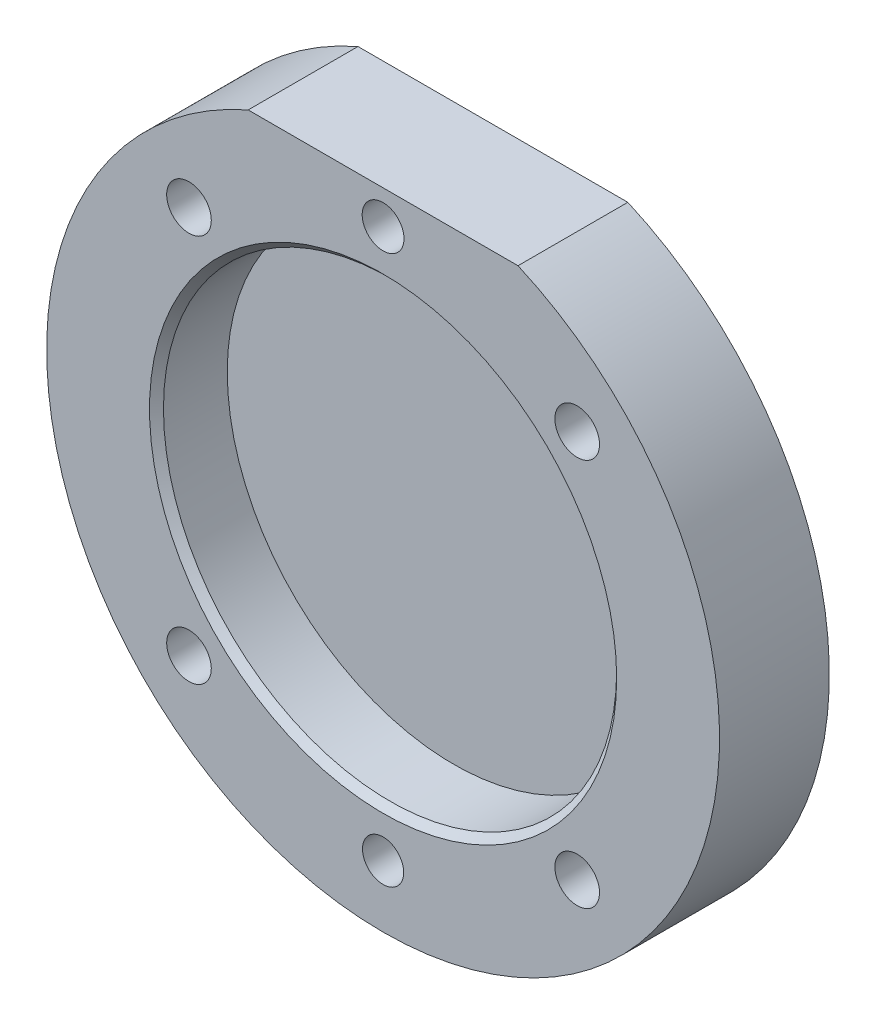
ISO-10303-21;
HEADER;
FILE_DESCRIPTION(('STEP AP214'),'2;1');
FILE_NAME('part.step','',(''),(''),'','','');
FILE_SCHEMA(('AUTOMOTIVE_DESIGN { 1 0 10303 214 1 1 1 1 }'));
ENDSEC;
DATA;
#1=APPLICATION_CONTEXT('core data for automotive mechanical design processes');
#2=APPLICATION_PROTOCOL_DEFINITION('international standard','automotive_design',2000,#1);
#3=PRODUCT_CONTEXT('',#1,'mechanical');
#4=PRODUCT('Part','Part','',(#3));
#5=PRODUCT_RELATED_PRODUCT_CATEGORY('part','',(#4));
#6=PRODUCT_DEFINITION_FORMATION('','',#4);
#7=PRODUCT_DEFINITION_CONTEXT('part definition',#1,'design');
#8=PRODUCT_DEFINITION('design','',#6,#7);
#9=PRODUCT_DEFINITION_SHAPE('','',#8);
#10=(LENGTH_UNIT() NAMED_UNIT(*) SI_UNIT(.MILLI.,.METRE.));
#11=(NAMED_UNIT(*) PLANE_ANGLE_UNIT() SI_UNIT($,.RADIAN.));
#12=(NAMED_UNIT(*) SI_UNIT($,.STERADIAN.) SOLID_ANGLE_UNIT());
#13=UNCERTAINTY_MEASURE_WITH_UNIT(LENGTH_MEASURE(1.E-05),#10,'distance_accuracy_value','');
#14=(GEOMETRIC_REPRESENTATION_CONTEXT(3) GLOBAL_UNCERTAINTY_ASSIGNED_CONTEXT((#13)) GLOBAL_UNIT_ASSIGNED_CONTEXT((#10,
#11,#12)) REPRESENTATION_CONTEXT('',''));
#15=CARTESIAN_POINT('',(0.,0.,0.));
#16=DIRECTION('',(0.,0.,1.));
#17=DIRECTION('',(1.,0.,0.));
#18=AXIS2_PLACEMENT_3D('',#15,#16,#17);
#19=CARTESIAN_POINT('',(0.,0.,8.001));
#20=DIRECTION('',(0.,0.,-1.));
#21=DIRECTION('',(-1.,0.,0.));
#22=AXIS2_PLACEMENT_3D('',#19,#20,#21);
#23=CYLINDRICAL_SURFACE('',#22,24.511);
#24=CARTESIAN_POINT('',(0.,0.,0.));
#25=DIRECTION('',(0.,0.,1.));
#26=DIRECTION('',(1.,0.,0.));
#27=AXIS2_PLACEMENT_3D('',#24,#25,#26);
#28=CIRCLE('',#27,24.511);
#29=CARTESIAN_POINT('',(-9.82979999999999,22.4536,0.));
#30=VERTEX_POINT('',#29);
#31=CARTESIAN_POINT('',(9.82979999999999,22.4536,0.));
#32=VERTEX_POINT('',#31);
#33=EDGE_CURVE('E68',#30,#32,#28,.T.);
#34=ORIENTED_EDGE('',*,*,#33,.T.);
#35=DIRECTION('',(0.,0.,-1.));
#36=VECTOR('',#35,1.);
#37=CARTESIAN_POINT('',(9.82979999999999,22.4536,8.001));
#38=LINE('',#37,#36);
#39=CARTESIAN_POINT('',(9.82979999999999,22.4536,8.001));
#40=VERTEX_POINT('',#39);
#41=EDGE_CURVE('E65',#40,#32,#38,.T.);
#42=ORIENTED_EDGE('',*,*,#41,.F.);
#43=CARTESIAN_POINT('',(0.,0.,8.001));
#44=DIRECTION('',(0.,0.,1.));
#45=DIRECTION('',(1.,0.,0.));
#46=AXIS2_PLACEMENT_3D('',#43,#44,#45);
#47=CIRCLE('',#46,24.511);
#48=CARTESIAN_POINT('',(-9.82979999999999,22.4536,8.001));
#49=VERTEX_POINT('',#48);
#50=EDGE_CURVE('E67',#49,#40,#47,.T.);
#51=ORIENTED_EDGE('',*,*,#50,.F.);
#52=DIRECTION('',(0.,0.,-1.));
#53=VECTOR('',#52,1.);
#54=CARTESIAN_POINT('',(-9.82979999999999,22.4536,8.001));
#55=LINE('',#54,#53);
#56=EDGE_CURVE('E62',#49,#30,#55,.T.);
#57=ORIENTED_EDGE('',*,*,#56,.T.);
#58=EDGE_LOOP('',(#34,#42,#51,#57));
#59=FACE_BOUND('',#58,.T.);
#60=ADVANCED_FACE('F33',(#59),#23,.T.);
#61=CARTESIAN_POINT('',(-9.82979999999999,22.4536,8.001));
#62=DIRECTION('',(0.,-1.,0.));
#63=DIRECTION('',(0.,0.,-1.));
#64=AXIS2_PLACEMENT_3D('',#61,#62,#63);
#65=PLANE('',#64);
#66=DIRECTION('',(-1.,0.,0.));
#67=VECTOR('',#66,1.);
#68=CARTESIAN_POINT('',(-9.82979999999999,22.4536,0.));
#69=LINE('',#68,#67);
#70=EDGE_CURVE('E57',#32,#30,#69,.T.);
#71=ORIENTED_EDGE('',*,*,#70,.T.);
#72=ORIENTED_EDGE('',*,*,#56,.F.);
#73=DIRECTION('',(-1.,0.,0.));
#74=VECTOR('',#73,1.);
#75=CARTESIAN_POINT('',(-9.82979999999999,22.4536,8.001));
#76=LINE('',#75,#74);
#77=EDGE_CURVE('E49',#40,#49,#76,.T.);
#78=ORIENTED_EDGE('',*,*,#77,.F.);
#79=ORIENTED_EDGE('',*,*,#41,.T.);
#80=EDGE_LOOP('',(#71,#72,#78,#79));
#81=FACE_BOUND('',#80,.T.);
#82=ADVANCED_FACE('F61',(#81),#65,.F.);
#83=CARTESIAN_POINT('',(0.,0.,8.001));
#84=DIRECTION('',(0.,0.,1.));
#85=DIRECTION('',(1.,0.,0.));
#86=AXIS2_PLACEMENT_3D('',#83,#84,#85);
#87=PLANE('',#86);
#88=CARTESIAN_POINT('',(0.,0.,8.001));
#89=DIRECTION('',(0.,0.,1.));
#90=DIRECTION('',(1.,0.,0.));
#91=AXIS2_PLACEMENT_3D('',#88,#89,#90);
#92=CIRCLE('',#91,17.018);
#93=CARTESIAN_POINT('',(17.018,0.,8.001));
#94=VERTEX_POINT('',#93);
#95=EDGE_CURVE('E11',#94,#94,#92,.F.);
#96=ORIENTED_EDGE('',*,*,#95,.T.);
#97=EDGE_LOOP('',(#96));
#98=FACE_BOUND('',#97,.T.);
#99=CARTESIAN_POINT('',(0.,-20.0025,8.001));
#100=DIRECTION('',(0.,0.,1.));
#101=DIRECTION('',(1.,0.,0.));
#102=AXIS2_PLACEMENT_3D('',#99,#100,#101);
#103=CIRCLE('',#102,1.49987000000001);
#104=CARTESIAN_POINT('',(1.49987000000002,-20.0025,8.001));
#105=VERTEX_POINT('',#104);
#106=EDGE_CURVE('E214',#105,#105,#103,.T.);
#107=ORIENTED_EDGE('',*,*,#106,.F.);
#108=EDGE_LOOP('',(#107));
#109=FACE_BOUND('',#108,.T.);
#110=CARTESIAN_POINT('',(-14.1421073394598,-14.1421073394596,8.00100000000004));
#111=DIRECTION('',(0.,0.,1.));
#112=DIRECTION('',(0.,-1.,0.));
#113=AXIS2_PLACEMENT_3D('',#110,#111,#112);
#114=CIRCLE('',#113,1.62560000000001);
#115=CARTESIAN_POINT('',(-14.1421073394598,-15.7677073394596,8.00100000000004));
#116=VERTEX_POINT('',#115);
#117=EDGE_CURVE('E216',#116,#116,#114,.T.);
#118=ORIENTED_EDGE('',*,*,#117,.F.);
#119=EDGE_LOOP('',(#118));
#120=FACE_BOUND('',#119,.T.);
#121=CARTESIAN_POINT('',(14.1421073394596,-14.1421073394598,8.00100000000003));
#122=DIRECTION('',(0.,0.,1.));
#123=DIRECTION('',(0.,-1.,0.));
#124=AXIS2_PLACEMENT_3D('',#121,#122,#123);
#125=CIRCLE('',#124,1.62560000000001);
#126=CARTESIAN_POINT('',(14.1421073394596,-15.7677073394598,8.00100000000004));
#127=VERTEX_POINT('',#126);
#128=EDGE_CURVE('E227',#127,#127,#125,.T.);
#129=ORIENTED_EDGE('',*,*,#128,.F.);
#130=EDGE_LOOP('',(#129));
#131=FACE_BOUND('',#130,.T.);
#132=CARTESIAN_POINT('',(14.1421073394597,14.1421073394597,8.00099999999999));
#133=DIRECTION('',(0.,0.,1.));
#134=DIRECTION('',(0.,-1.,0.));
#135=AXIS2_PLACEMENT_3D('',#132,#133,#134);
#136=CIRCLE('',#135,1.62560000000001);
#137=CARTESIAN_POINT('',(14.1421073394597,12.5165073394597,8.00099999999999));
#138=VERTEX_POINT('',#137);
#139=EDGE_CURVE('E233',#138,#138,#136,.T.);
#140=ORIENTED_EDGE('',*,*,#139,.F.);
#141=EDGE_LOOP('',(#140));
#142=FACE_BOUND('',#141,.T.);
#143=CARTESIAN_POINT('',(-14.1421073394597,14.1421073394597,8.001));
#144=DIRECTION('',(0.,0.,1.));
#145=DIRECTION('',(1.,0.,0.));
#146=AXIS2_PLACEMENT_3D('',#143,#144,#145);
#147=CIRCLE('',#146,1.62560000000001);
#148=CARTESIAN_POINT('',(-12.5165073394597,14.1421073394597,8.001));
#149=VERTEX_POINT('',#148);
#150=EDGE_CURVE('E239',#149,#149,#147,.T.);
#151=ORIENTED_EDGE('',*,*,#150,.F.);
#152=EDGE_LOOP('',(#151));
#153=FACE_BOUND('',#152,.T.);
#154=CARTESIAN_POINT('',(0.,19.99996,8.001));
#155=DIRECTION('',(0.,0.,1.));
#156=DIRECTION('',(1.,0.,0.));
#157=AXIS2_PLACEMENT_3D('',#154,#155,#156);
#158=CIRCLE('',#157,1.52400000000001);
#159=CARTESIAN_POINT('',(1.52400000000001,19.99996,8.001));
#160=VERTEX_POINT('',#159);
#161=EDGE_CURVE('E76',#160,#160,#158,.T.);
#162=ORIENTED_EDGE('',*,*,#161,.F.);
#163=EDGE_LOOP('',(#162));
#164=FACE_BOUND('',#163,.T.);
#165=ORIENTED_EDGE('',*,*,#50,.T.);
#166=ORIENTED_EDGE('',*,*,#77,.T.);
#167=EDGE_LOOP('',(#165,#166));
#168=FACE_BOUND('',#167,.T.);
#169=ADVANCED_FACE('F100',(#98,#109,#120,#131,#142,#153,#164,#168),#87,.T.);
#170=CARTESIAN_POINT('',(0.,0.,0.));
#171=DIRECTION('',(0.,0.,1.));
#172=DIRECTION('',(1.,0.,0.));
#173=AXIS2_PLACEMENT_3D('',#170,#171,#172);
#174=PLANE('',#173);
#175=CARTESIAN_POINT('',(0.,-20.0025,0.));
#176=DIRECTION('',(0.,0.,1.));
#177=DIRECTION('',(1.,0.,0.));
#178=AXIS2_PLACEMENT_3D('',#175,#176,#177);
#179=CIRCLE('',#178,1.49987000000001);
#180=CARTESIAN_POINT('',(1.49987000000001,-20.0025,0.));
#181=VERTEX_POINT('',#180);
#182=EDGE_CURVE('E211',#181,#181,#179,.T.);
#183=ORIENTED_EDGE('',*,*,#182,.T.);
#184=EDGE_LOOP('',(#183));
#185=FACE_BOUND('',#184,.T.);
#186=CARTESIAN_POINT('',(-14.1421073394598,-14.1421073394596,0.));
#187=DIRECTION('',(0.,0.,1.));
#188=DIRECTION('',(0.,-1.,0.));
#189=AXIS2_PLACEMENT_3D('',#186,#187,#188);
#190=CIRCLE('',#189,1.62560000000001);
#191=CARTESIAN_POINT('',(-14.1421073394598,-15.7677073394596,0.));
#192=VERTEX_POINT('',#191);
#193=EDGE_CURVE('E219',#192,#192,#190,.T.);
#194=ORIENTED_EDGE('',*,*,#193,.T.);
#195=EDGE_LOOP('',(#194));
#196=FACE_BOUND('',#195,.T.);
#197=CARTESIAN_POINT('',(14.1421073394596,-14.1421073394598,0.));
#198=DIRECTION('',(0.,0.,1.));
#199=DIRECTION('',(0.,-1.,0.));
#200=AXIS2_PLACEMENT_3D('',#197,#198,#199);
#201=CIRCLE('',#200,1.62560000000001);
#202=CARTESIAN_POINT('',(14.1421073394596,-15.7677073394598,0.));
#203=VERTEX_POINT('',#202);
#204=EDGE_CURVE('E230',#203,#203,#201,.T.);
#205=ORIENTED_EDGE('',*,*,#204,.T.);
#206=EDGE_LOOP('',(#205));
#207=FACE_BOUND('',#206,.T.);
#208=CARTESIAN_POINT('',(14.1421073394597,14.1421073394597,0.));
#209=DIRECTION('',(0.,0.,1.));
#210=DIRECTION('',(0.,-1.,0.));
#211=AXIS2_PLACEMENT_3D('',#208,#209,#210);
#212=CIRCLE('',#211,1.62560000000001);
#213=CARTESIAN_POINT('',(14.1421073394597,12.5165073394597,0.));
#214=VERTEX_POINT('',#213);
#215=EDGE_CURVE('E236',#214,#214,#212,.T.);
#216=ORIENTED_EDGE('',*,*,#215,.T.);
#217=EDGE_LOOP('',(#216));
#218=FACE_BOUND('',#217,.T.);
#219=CARTESIAN_POINT('',(-14.1421073394597,14.1421073394597,0.));
#220=DIRECTION('',(0.,0.,1.));
#221=DIRECTION('',(1.,0.,0.));
#222=AXIS2_PLACEMENT_3D('',#219,#220,#221);
#223=CIRCLE('',#222,1.62560000000001);
#224=CARTESIAN_POINT('',(-12.5165073394597,14.1421073394597,0.));
#225=VERTEX_POINT('',#224);
#226=EDGE_CURVE('E242',#225,#225,#223,.T.);
#227=ORIENTED_EDGE('',*,*,#226,.T.);
#228=EDGE_LOOP('',(#227));
#229=FACE_BOUND('',#228,.T.);
#230=CARTESIAN_POINT('',(0.,19.99996,0.));
#231=DIRECTION('',(0.,0.,1.));
#232=DIRECTION('',(1.,0.,0.));
#233=AXIS2_PLACEMENT_3D('',#230,#231,#232);
#234=CIRCLE('',#233,1.52400000000001);
#235=CARTESIAN_POINT('',(1.52400000000001,19.99996,0.));
#236=VERTEX_POINT('',#235);
#237=EDGE_CURVE('E73',#236,#236,#234,.T.);
#238=ORIENTED_EDGE('',*,*,#237,.T.);
#239=EDGE_LOOP('',(#238));
#240=FACE_BOUND('',#239,.T.);
#241=ORIENTED_EDGE('',*,*,#33,.F.);
#242=ORIENTED_EDGE('',*,*,#70,.F.);
#243=EDGE_LOOP('',(#241,#242));
#244=FACE_BOUND('',#243,.T.);
#245=ADVANCED_FACE('F72',(#185,#196,#207,#218,#229,#240,#244),#174,.F.);
#246=CARTESIAN_POINT('',(0.,19.99996,8.001));
#247=DIRECTION('',(0.,0.,1.));
#248=DIRECTION('',(1.,0.,0.));
#249=AXIS2_PLACEMENT_3D('',#246,#247,#248);
#250=CYLINDRICAL_SURFACE('',#249,1.52400000000001);
#251=ORIENTED_EDGE('',*,*,#237,.F.);
#252=EDGE_LOOP('',(#251));
#253=FACE_BOUND('',#252,.T.);
#254=ORIENTED_EDGE('',*,*,#161,.T.);
#255=EDGE_LOOP('',(#254));
#256=FACE_BOUND('',#255,.T.);
#257=ADVANCED_FACE('F105',(#253,#256),#250,.F.);
#258=CARTESIAN_POINT('',(-14.1421073394597,14.1421073394597,8.001));
#259=DIRECTION('',(0.,0.,1.));
#260=DIRECTION('',(1.,0.,0.));
#261=AXIS2_PLACEMENT_3D('',#258,#259,#260);
#262=CYLINDRICAL_SURFACE('',#261,1.62560000000001);
#263=ORIENTED_EDGE('',*,*,#226,.F.);
#264=EDGE_LOOP('',(#263));
#265=FACE_BOUND('',#264,.T.);
#266=ORIENTED_EDGE('',*,*,#150,.T.);
#267=EDGE_LOOP('',(#266));
#268=FACE_BOUND('',#267,.T.);
#269=ADVANCED_FACE('F112',(#265,#268),#262,.F.);
#270=CARTESIAN_POINT('',(14.1421073394597,14.1421073394597,8.00099999999999));
#271=DIRECTION('',(0.,0.,1.));
#272=DIRECTION('',(0.,-1.,0.));
#273=AXIS2_PLACEMENT_3D('',#270,#271,#272);
#274=CYLINDRICAL_SURFACE('',#273,1.62560000000001);
#275=ORIENTED_EDGE('',*,*,#215,.F.);
#276=EDGE_LOOP('',(#275));
#277=FACE_BOUND('',#276,.T.);
#278=ORIENTED_EDGE('',*,*,#139,.T.);
#279=EDGE_LOOP('',(#278));
#280=FACE_BOUND('',#279,.T.);
#281=ADVANCED_FACE('F116',(#277,#280),#274,.F.);
#282=CARTESIAN_POINT('',(14.1421073394596,-14.1421073394598,8.00100000000003));
#283=DIRECTION('',(0.,0.,1.));
#284=DIRECTION('',(0.,-1.,0.));
#285=AXIS2_PLACEMENT_3D('',#282,#283,#284);
#286=CYLINDRICAL_SURFACE('',#285,1.62560000000001);
#287=ORIENTED_EDGE('',*,*,#204,.F.);
#288=EDGE_LOOP('',(#287));
#289=FACE_BOUND('',#288,.T.);
#290=ORIENTED_EDGE('',*,*,#128,.T.);
#291=EDGE_LOOP('',(#290));
#292=FACE_BOUND('',#291,.T.);
#293=ADVANCED_FACE('F120',(#289,#292),#286,.F.);
#294=CARTESIAN_POINT('',(-14.1421073394598,-14.1421073394596,8.00100000000004));
#295=DIRECTION('',(0.,0.,1.));
#296=DIRECTION('',(0.,-1.,0.));
#297=AXIS2_PLACEMENT_3D('',#294,#295,#296);
#298=CYLINDRICAL_SURFACE('',#297,1.62560000000001);
#299=ORIENTED_EDGE('',*,*,#193,.F.);
#300=EDGE_LOOP('',(#299));
#301=FACE_BOUND('',#300,.T.);
#302=ORIENTED_EDGE('',*,*,#117,.T.);
#303=EDGE_LOOP('',(#302));
#304=FACE_BOUND('',#303,.T.);
#305=ADVANCED_FACE('F124',(#301,#304),#298,.F.);
#306=CARTESIAN_POINT('',(0.,-20.0025,8.001));
#307=DIRECTION('',(0.,0.,1.));
#308=DIRECTION('',(1.,0.,0.));
#309=AXIS2_PLACEMENT_3D('',#306,#307,#308);
#310=CYLINDRICAL_SURFACE('',#309,1.49987000000001);
#311=ORIENTED_EDGE('',*,*,#182,.F.);
#312=EDGE_LOOP('',(#311));
#313=FACE_BOUND('',#312,.T.);
#314=ORIENTED_EDGE('',*,*,#106,.T.);
#315=EDGE_LOOP('',(#314));
#316=FACE_BOUND('',#315,.T.);
#317=ADVANCED_FACE('F128',(#313,#316),#310,.F.);
#318=CARTESIAN_POINT('',(0.,0.,2.8448));
#319=DIRECTION('',(0.,0.,1.));
#320=DIRECTION('',(1.,0.,0.));
#321=AXIS2_PLACEMENT_3D('',#318,#319,#320);
#322=CYLINDRICAL_SURFACE('',#321,16.51);
#323=CARTESIAN_POINT('',(0.,0.,7.493));
#324=DIRECTION('',(0.,0.,1.));
#325=DIRECTION('',(1.,0.,0.));
#326=AXIS2_PLACEMENT_3D('',#323,#324,#325);
#327=CIRCLE('',#326,16.51);
#328=CARTESIAN_POINT('',(16.51,0.,7.493));
#329=VERTEX_POINT('',#328);
#330=EDGE_CURVE('E42',#329,#329,#327,.T.);
#331=ORIENTED_EDGE('',*,*,#330,.T.);
#332=EDGE_LOOP('',(#331));
#333=FACE_BOUND('',#332,.T.);
#334=CARTESIAN_POINT('',(0.,0.,2.8448));
#335=DIRECTION('',(0.,0.,1.));
#336=DIRECTION('',(1.,0.,0.));
#337=AXIS2_PLACEMENT_3D('',#334,#335,#336);
#338=CIRCLE('',#337,16.51);
#339=CARTESIAN_POINT('',(16.51,0.,2.8448));
#340=VERTEX_POINT('',#339);
#341=EDGE_CURVE('E221',#340,#340,#338,.T.);
#342=ORIENTED_EDGE('',*,*,#341,.F.);
#343=EDGE_LOOP('',(#342));
#344=FACE_BOUND('',#343,.T.);
#345=ADVANCED_FACE('F84',(#333,#344),#322,.F.);
#346=CARTESIAN_POINT('',(0.,0.,2.8448));
#347=DIRECTION('',(0.,0.,1.));
#348=DIRECTION('',(1.,0.,0.));
#349=AXIS2_PLACEMENT_3D('',#346,#347,#348);
#350=PLANE('',#349);
#351=ORIENTED_EDGE('',*,*,#341,.T.);
#352=EDGE_LOOP('',(#351));
#353=FACE_BOUND('',#352,.T.);
#354=ADVANCED_FACE('F88',(#353),#350,.T.);
#355=CARTESIAN_POINT('',(0.,0.,7.493));
#356=DIRECTION('',(0.,0.,1.));
#357=DIRECTION('',(1.,0.,0.));
#358=AXIS2_PLACEMENT_3D('',#355,#356,#357);
#359=CONICAL_SURFACE('',#358,16.51,0.78539816339745);
#360=ORIENTED_EDGE('',*,*,#95,.F.);
#361=EDGE_LOOP('',(#360));
#362=FACE_BOUND('',#361,.T.);
#363=ORIENTED_EDGE('',*,*,#330,.F.);
#364=EDGE_LOOP('',(#363));
#365=FACE_BOUND('',#364,.T.);
#366=ADVANCED_FACE('F35',(#362,#365),#359,.F.);
#367=CLOSED_SHELL('',(#60,#82,#169,#245,#257,#269,#281,#293,#305,#317,#345,#354,#366));
#368=MANIFOLD_SOLID_BREP('B2',#367);
#369=ADVANCED_BREP_SHAPE_REPRESENTATION('',(#18,#368),#14);
#370=SHAPE_DEFINITION_REPRESENTATION(#9,#369);
ENDSEC;
END-ISO-10303-21;
